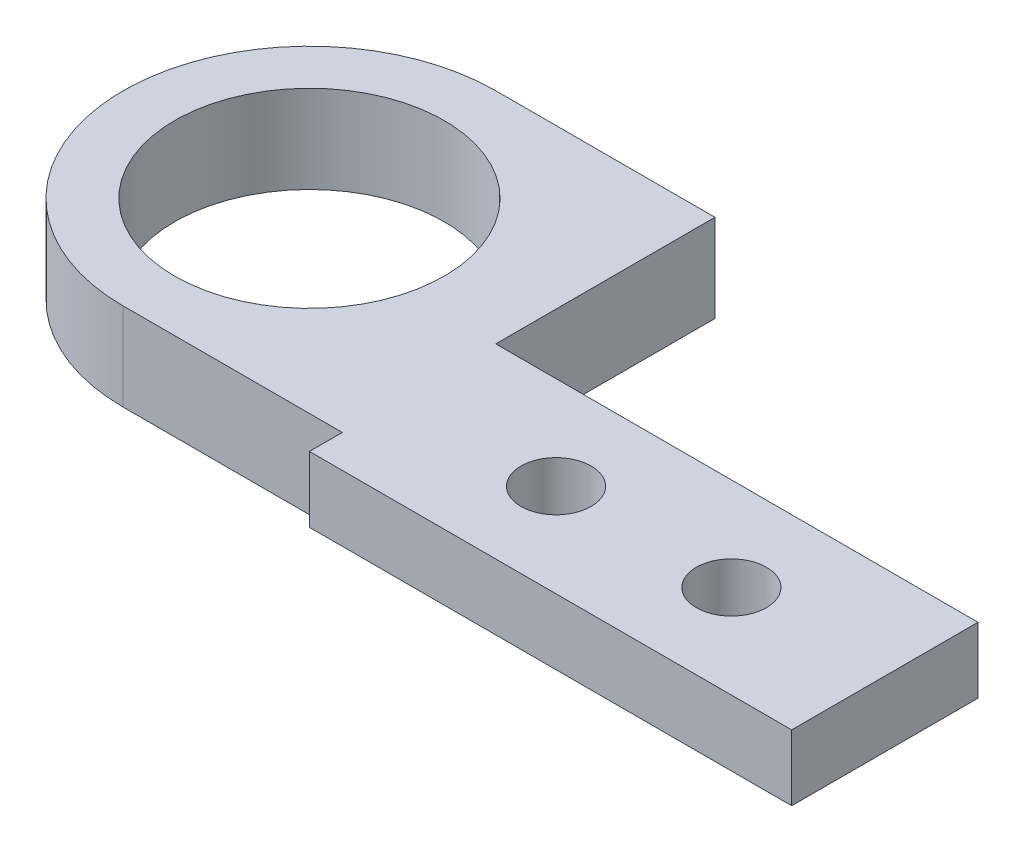
ISO-10303-21;
HEADER;
FILE_DESCRIPTION(('STEP AP214'),'2;1');
FILE_NAME('part.step','',(''),(''),'','','');
FILE_SCHEMA(('AUTOMOTIVE_DESIGN { 1 0 10303 214 1 1 1 1 }'));
ENDSEC;
DATA;
#1=APPLICATION_CONTEXT('core data for automotive mechanical design processes');
#2=APPLICATION_PROTOCOL_DEFINITION('international standard','automotive_design',2000,#1);
#3=PRODUCT_CONTEXT('',#1,'mechanical');
#4=PRODUCT('Part','Part','',(#3));
#5=PRODUCT_RELATED_PRODUCT_CATEGORY('part','',(#4));
#6=PRODUCT_DEFINITION_FORMATION('','',#4);
#7=PRODUCT_DEFINITION_CONTEXT('part definition',#1,'design');
#8=PRODUCT_DEFINITION('design','',#6,#7);
#9=PRODUCT_DEFINITION_SHAPE('','',#8);
#10=(LENGTH_UNIT() NAMED_UNIT(*) SI_UNIT(.MILLI.,.METRE.));
#11=(NAMED_UNIT(*) PLANE_ANGLE_UNIT() SI_UNIT($,.RADIAN.));
#12=(NAMED_UNIT(*) SI_UNIT($,.STERADIAN.) SOLID_ANGLE_UNIT());
#13=UNCERTAINTY_MEASURE_WITH_UNIT(LENGTH_MEASURE(1.E-05),#10,'distance_accuracy_value','');
#14=(GEOMETRIC_REPRESENTATION_CONTEXT(3) GLOBAL_UNCERTAINTY_ASSIGNED_CONTEXT((#13)) GLOBAL_UNIT_ASSIGNED_CONTEXT((#10,
#11,#12)) REPRESENTATION_CONTEXT('',''));
#15=CARTESIAN_POINT('',(0.,0.,0.));
#16=DIRECTION('',(0.,0.,1.));
#17=DIRECTION('',(1.,0.,0.));
#18=AXIS2_PLACEMENT_3D('',#15,#16,#17);
#19=CARTESIAN_POINT('',(2.21091127309406,4.,0.));
#20=DIRECTION('',(-1.,0.,0.));
#21=DIRECTION('',(0.,0.,1.));
#22=AXIS2_PLACEMENT_3D('',#19,#20,#21);
#23=PLANE('',#22);
#24=DIRECTION('',(0.,1.,0.));
#25=VECTOR('',#24,1.);
#26=CARTESIAN_POINT('',(2.21091127309406,1.,1.5));
#27=LINE('',#26,#25);
#28=CARTESIAN_POINT('',(2.21091127309406,1.,1.5));
#29=VERTEX_POINT('',#28);
#30=CARTESIAN_POINT('',(2.21091127309406,4.,1.5));
#31=VERTEX_POINT('',#30);
#32=EDGE_CURVE('E129',#29,#31,#27,.T.);
#33=ORIENTED_EDGE('',*,*,#32,.F.);
#34=DIRECTION('',(0.,0.,1.));
#35=VECTOR('',#34,1.);
#36=CARTESIAN_POINT('',(2.21091127309406,1.,1.5));
#37=LINE('',#36,#35);
#38=CARTESIAN_POINT('',(2.21091127309406,1.,8.5));
#39=VERTEX_POINT('',#38);
#40=EDGE_CURVE('E134',#29,#39,#37,.T.);
#41=ORIENTED_EDGE('',*,*,#40,.T.);
#42=DIRECTION('',(0.,-1.,0.));
#43=VECTOR('',#42,1.);
#44=CARTESIAN_POINT('',(2.21091127309406,4.,8.5));
#45=LINE('',#44,#43);
#46=CARTESIAN_POINT('',(2.21091127309406,0.,8.5));
#47=VERTEX_POINT('',#46);
#48=EDGE_CURVE('E179',#39,#47,#45,.T.);
#49=ORIENTED_EDGE('',*,*,#48,.T.);
#50=DIRECTION('',(0.,0.,-1.));
#51=VECTOR('',#50,1.);
#52=CARTESIAN_POINT('',(2.21091127309406,0.,0.));
#53=LINE('',#52,#51);
#54=CARTESIAN_POINT('',(2.21091127309407,0.,-8.5));
#55=VERTEX_POINT('',#54);
#56=EDGE_CURVE('E157',#47,#55,#53,.T.);
#57=ORIENTED_EDGE('',*,*,#56,.T.);
#58=DIRECTION('',(0.,-1.,0.));
#59=VECTOR('',#58,1.);
#60=CARTESIAN_POINT('',(2.21091127309407,4.,-8.5));
#61=LINE('',#60,#59);
#62=CARTESIAN_POINT('',(2.21091127309407,4.,-8.5));
#63=VERTEX_POINT('',#62);
#64=EDGE_CURVE('E81',#63,#55,#61,.T.);
#65=ORIENTED_EDGE('',*,*,#64,.F.);
#66=DIRECTION('',(0.,0.,-1.));
#67=VECTOR('',#66,1.);
#68=CARTESIAN_POINT('',(2.21091127309406,4.,0.));
#69=LINE('',#68,#67);
#70=EDGE_CURVE('E61',#31,#63,#69,.T.);
#71=ORIENTED_EDGE('',*,*,#70,.F.);
#72=EDGE_LOOP('',(#33,#41,#49,#57,#65,#71));
#73=FACE_BOUND('',#72,.T.);
#74=ADVANCED_FACE('F35',(#73),#23,.F.);
#75=CARTESIAN_POINT('',(0.,4.,-8.5));
#76=DIRECTION('',(0.,0.,-1.));
#77=DIRECTION('',(-1.,0.,0.));
#78=AXIS2_PLACEMENT_3D('',#75,#76,#77);
#79=PLANE('',#78);
#80=DIRECTION('',(1.,0.,0.));
#81=VECTOR('',#80,1.);
#82=CARTESIAN_POINT('',(0.,0.,-8.5));
#83=LINE('',#82,#81);
#84=CARTESIAN_POINT('',(-7.78908872690593,0.,-8.5));
#85=VERTEX_POINT('',#84);
#86=EDGE_CURVE('E168',#85,#55,#83,.T.);
#87=ORIENTED_EDGE('',*,*,#86,.F.);
#88=DIRECTION('',(0.,-1.,0.));
#89=VECTOR('',#88,1.);
#90=CARTESIAN_POINT('',(-7.78908872690593,4.,-8.5));
#91=LINE('',#90,#89);
#92=CARTESIAN_POINT('',(-7.78908872690593,4.,-8.5));
#93=VERTEX_POINT('',#92);
#94=EDGE_CURVE('E11',#93,#85,#91,.T.);
#95=ORIENTED_EDGE('',*,*,#94,.F.);
#96=DIRECTION('',(1.,0.,0.));
#97=VECTOR('',#96,1.);
#98=CARTESIAN_POINT('',(0.,4.,-8.5));
#99=LINE('',#98,#97);
#100=EDGE_CURVE('E156',#93,#63,#99,.T.);
#101=ORIENTED_EDGE('',*,*,#100,.T.);
#102=ORIENTED_EDGE('',*,*,#64,.T.);
#103=EDGE_LOOP('',(#87,#95,#101,#102));
#104=FACE_BOUND('',#103,.T.);
#105=ADVANCED_FACE('F208',(#104),#79,.T.);
#106=CARTESIAN_POINT('',(-7.78908872690593,4.,0.));
#107=DIRECTION('',(0.,-1.,0.));
#108=DIRECTION('',(0.,0.,-1.));
#109=AXIS2_PLACEMENT_3D('',#106,#107,#108);
#110=CYLINDRICAL_SURFACE('',#109,8.5);
#111=CARTESIAN_POINT('',(-7.78908872690593,0.,0.));
#112=DIRECTION('',(0.,1.,0.));
#113=DIRECTION('',(0.,0.,1.));
#114=AXIS2_PLACEMENT_3D('',#111,#112,#113);
#115=CIRCLE('',#114,8.5);
#116=CARTESIAN_POINT('',(-7.78908872690593,0.,8.5));
#117=VERTEX_POINT('',#116);
#118=EDGE_CURVE('E171',#85,#117,#115,.T.);
#119=ORIENTED_EDGE('',*,*,#118,.T.);
#120=DIRECTION('',(0.,-1.,0.));
#121=VECTOR('',#120,1.);
#122=CARTESIAN_POINT('',(-7.78908872690593,4.,8.5));
#123=LINE('',#122,#121);
#124=CARTESIAN_POINT('',(-7.78908872690593,4.,8.5));
#125=VERTEX_POINT('',#124);
#126=EDGE_CURVE('E44',#125,#117,#123,.T.);
#127=ORIENTED_EDGE('',*,*,#126,.F.);
#128=CARTESIAN_POINT('',(-7.78908872690593,4.,0.));
#129=DIRECTION('',(0.,1.,0.));
#130=DIRECTION('',(0.,0.,1.));
#131=AXIS2_PLACEMENT_3D('',#128,#129,#130);
#132=CIRCLE('',#131,8.5);
#133=EDGE_CURVE('E159',#93,#125,#132,.T.);
#134=ORIENTED_EDGE('',*,*,#133,.F.);
#135=ORIENTED_EDGE('',*,*,#94,.T.);
#136=EDGE_LOOP('',(#119,#127,#134,#135));
#137=FACE_BOUND('',#136,.T.);
#138=ADVANCED_FACE('F210',(#137),#110,.T.);
#139=CARTESIAN_POINT('',(0.,4.,8.5));
#140=DIRECTION('',(0.,0.,-1.));
#141=DIRECTION('',(-1.,0.,0.));
#142=AXIS2_PLACEMENT_3D('',#139,#140,#141);
#143=PLANE('',#142);
#144=DIRECTION('',(1.,0.,0.));
#145=VECTOR('',#144,1.);
#146=CARTESIAN_POINT('',(0.,0.,8.5));
#147=LINE('',#146,#145);
#148=EDGE_CURVE('E174',#117,#47,#147,.T.);
#149=ORIENTED_EDGE('',*,*,#148,.T.);
#150=ORIENTED_EDGE('',*,*,#48,.F.);
#151=CARTESIAN_POINT('',(2.21091127309406,4.,8.5));
#152=VERTEX_POINT('',#151);
#153=EDGE_CURVE('E180',#152,#39,#45,.T.);
#154=ORIENTED_EDGE('',*,*,#153,.F.);
#155=DIRECTION('',(1.,0.,0.));
#156=VECTOR('',#155,1.);
#157=CARTESIAN_POINT('',(0.,4.,8.5));
#158=LINE('',#157,#156);
#159=EDGE_CURVE('E162',#125,#152,#158,.T.);
#160=ORIENTED_EDGE('',*,*,#159,.F.);
#161=ORIENTED_EDGE('',*,*,#126,.T.);
#162=EDGE_LOOP('',(#149,#150,#154,#160,#161));
#163=FACE_BOUND('',#162,.T.);
#164=ADVANCED_FACE('F215',(#163),#143,.F.);
#165=CARTESIAN_POINT('',(-7.78908872690593,4.,0.));
#166=DIRECTION('',(0.,-1.,0.));
#167=DIRECTION('',(0.,0.,-1.));
#168=AXIS2_PLACEMENT_3D('',#165,#166,#167);
#169=CYLINDRICAL_SURFACE('',#168,6.15);
#170=CARTESIAN_POINT('',(-7.78908872690593,4.,0.));
#171=DIRECTION('',(0.,1.,0.));
#172=DIRECTION('',(0.,0.,1.));
#173=AXIS2_PLACEMENT_3D('',#170,#171,#172);
#174=CIRCLE('',#173,6.15);
#175=CARTESIAN_POINT('',(-7.78908872690593,4.,6.15));
#176=VERTEX_POINT('',#175);
#177=EDGE_CURVE('E153',#176,#176,#174,.T.);
#178=ORIENTED_EDGE('',*,*,#177,.T.);
#179=EDGE_LOOP('',(#178));
#180=FACE_BOUND('',#179,.T.);
#181=CARTESIAN_POINT('',(-7.78908872690593,0.,0.));
#182=DIRECTION('',(0.,1.,0.));
#183=DIRECTION('',(0.,0.,1.));
#184=AXIS2_PLACEMENT_3D('',#181,#182,#183);
#185=CIRCLE('',#184,6.15);
#186=CARTESIAN_POINT('',(-7.78908872690593,0.,6.15));
#187=VERTEX_POINT('',#186);
#188=EDGE_CURVE('E148',#187,#187,#185,.T.);
#189=ORIENTED_EDGE('',*,*,#188,.F.);
#190=EDGE_LOOP('',(#189));
#191=FACE_BOUND('',#190,.T.);
#192=ADVANCED_FACE('F37',(#180,#191),#169,.F.);
#193=CARTESIAN_POINT('',(0.,4.,0.));
#194=DIRECTION('',(0.,1.,0.));
#195=DIRECTION('',(0.,0.,1.));
#196=AXIS2_PLACEMENT_3D('',#193,#194,#195);
#197=PLANE('',#196);
#198=CARTESIAN_POINT('',(9.21091127309407,4.,5.75));
#199=DIRECTION('',(0.,1.,0.));
#200=DIRECTION('',(0.,0.,1.));
#201=AXIS2_PLACEMENT_3D('',#198,#199,#200);
#202=CIRCLE('',#201,1.6);
#203=CARTESIAN_POINT('',(9.21091127309407,4.,7.35));
#204=VERTEX_POINT('',#203);
#205=EDGE_CURVE('E185',#204,#204,#202,.T.);
#206=ORIENTED_EDGE('',*,*,#205,.F.);
#207=EDGE_LOOP('',(#206));
#208=FACE_BOUND('',#207,.T.);
#209=CARTESIAN_POINT('',(17.2109112730941,4.,5.75));
#210=DIRECTION('',(0.,1.,0.));
#211=DIRECTION('',(0.,0.,1.));
#212=AXIS2_PLACEMENT_3D('',#209,#210,#211);
#213=CIRCLE('',#212,1.6);
#214=CARTESIAN_POINT('',(17.2109112730941,4.,7.35));
#215=VERTEX_POINT('',#214);
#216=EDGE_CURVE('E190',#215,#215,#213,.T.);
#217=ORIENTED_EDGE('',*,*,#216,.F.);
#218=EDGE_LOOP('',(#217));
#219=FACE_BOUND('',#218,.T.);
#220=ORIENTED_EDGE('',*,*,#177,.F.);
#221=EDGE_LOOP('',(#220));
#222=FACE_BOUND('',#221,.T.);
#223=ORIENTED_EDGE('',*,*,#100,.F.);
#224=ORIENTED_EDGE('',*,*,#133,.T.);
#225=ORIENTED_EDGE('',*,*,#159,.T.);
#226=DIRECTION('',(0.,0.,1.));
#227=VECTOR('',#226,1.);
#228=CARTESIAN_POINT('',(2.21091127309406,4.,8.50000000000001));
#229=LINE('',#228,#227);
#230=CARTESIAN_POINT('',(2.21091127309406,4.,10.));
#231=VERTEX_POINT('',#230);
#232=EDGE_CURVE('E143',#152,#231,#229,.T.);
#233=ORIENTED_EDGE('',*,*,#232,.T.);
#234=DIRECTION('',(1.,0.,0.));
#235=VECTOR('',#234,1.);
#236=CARTESIAN_POINT('',(2.21091127309406,4.,10.));
#237=LINE('',#236,#235);
#238=CARTESIAN_POINT('',(24.2109112730941,4.,10.));
#239=VERTEX_POINT('',#238);
#240=EDGE_CURVE('E121',#231,#239,#237,.T.);
#241=ORIENTED_EDGE('',*,*,#240,.T.);
#242=DIRECTION('',(0.,0.,-1.));
#243=VECTOR('',#242,1.);
#244=CARTESIAN_POINT('',(24.2109112730941,4.,1.5));
#245=LINE('',#244,#243);
#246=CARTESIAN_POINT('',(24.2109112730941,4.,1.5));
#247=VERTEX_POINT('',#246);
#248=EDGE_CURVE('E140',#239,#247,#245,.T.);
#249=ORIENTED_EDGE('',*,*,#248,.T.);
#250=DIRECTION('',(-1.,0.,0.));
#251=VECTOR('',#250,1.);
#252=CARTESIAN_POINT('',(24.2109112730941,4.,1.5));
#253=LINE('',#252,#251);
#254=EDGE_CURVE('E127',#247,#31,#253,.T.);
#255=ORIENTED_EDGE('',*,*,#254,.T.);
#256=ORIENTED_EDGE('',*,*,#70,.T.);
#257=EDGE_LOOP('',(#223,#224,#225,#233,#241,#249,#255,#256));
#258=FACE_BOUND('',#257,.T.);
#259=ADVANCED_FACE('F200',(#208,#219,#222,#258),#197,.T.);
#260=CARTESIAN_POINT('',(0.,0.,0.));
#261=DIRECTION('',(0.,1.,0.));
#262=DIRECTION('',(0.,0.,1.));
#263=AXIS2_PLACEMENT_3D('',#260,#261,#262);
#264=PLANE('',#263);
#265=ORIENTED_EDGE('',*,*,#188,.T.);
#266=EDGE_LOOP('',(#265));
#267=FACE_BOUND('',#266,.T.);
#268=ORIENTED_EDGE('',*,*,#86,.T.);
#269=ORIENTED_EDGE('',*,*,#56,.F.);
#270=ORIENTED_EDGE('',*,*,#148,.F.);
#271=ORIENTED_EDGE('',*,*,#118,.F.);
#272=EDGE_LOOP('',(#268,#269,#270,#271));
#273=FACE_BOUND('',#272,.T.);
#274=ADVANCED_FACE('F203',(#267,#273),#264,.F.);
#275=CARTESIAN_POINT('',(2.21091127309406,1.,10.));
#276=DIRECTION('',(0.,0.,1.));
#277=DIRECTION('',(1.,0.,0.));
#278=AXIS2_PLACEMENT_3D('',#275,#276,#277);
#279=PLANE('',#278);
#280=ORIENTED_EDGE('',*,*,#240,.F.);
#281=DIRECTION('',(0.,1.,0.));
#282=VECTOR('',#281,1.);
#283=CARTESIAN_POINT('',(2.21091127309406,1.,10.));
#284=LINE('',#283,#282);
#285=CARTESIAN_POINT('',(2.21091127309406,1.,10.));
#286=VERTEX_POINT('',#285);
#287=EDGE_CURVE('E149',#286,#231,#284,.T.);
#288=ORIENTED_EDGE('',*,*,#287,.F.);
#289=DIRECTION('',(1.,0.,0.));
#290=VECTOR('',#289,1.);
#291=CARTESIAN_POINT('',(2.21091127309406,1.,10.));
#292=LINE('',#291,#290);
#293=CARTESIAN_POINT('',(24.2109112730941,1.,10.));
#294=VERTEX_POINT('',#293);
#295=EDGE_CURVE('E130',#286,#294,#292,.T.);
#296=ORIENTED_EDGE('',*,*,#295,.T.);
#297=DIRECTION('',(0.,1.,0.));
#298=VECTOR('',#297,1.);
#299=CARTESIAN_POINT('',(24.2109112730941,1.,10.));
#300=LINE('',#299,#298);
#301=EDGE_CURVE('E117',#294,#239,#300,.T.);
#302=ORIENTED_EDGE('',*,*,#301,.T.);
#303=EDGE_LOOP('',(#280,#288,#296,#302));
#304=FACE_BOUND('',#303,.T.);
#305=ADVANCED_FACE('F225',(#304),#279,.T.);
#306=CARTESIAN_POINT('',(2.21091127309406,1.,8.50000000000001));
#307=DIRECTION('',(-1.,0.,0.));
#308=DIRECTION('',(0.,0.,1.));
#309=AXIS2_PLACEMENT_3D('',#306,#307,#308);
#310=PLANE('',#309);
#311=ORIENTED_EDGE('',*,*,#232,.F.);
#312=ORIENTED_EDGE('',*,*,#153,.T.);
#313=EDGE_CURVE('E52',#39,#286,#37,.T.);
#314=ORIENTED_EDGE('',*,*,#313,.T.);
#315=ORIENTED_EDGE('',*,*,#287,.T.);
#316=EDGE_LOOP('',(#311,#312,#314,#315));
#317=FACE_BOUND('',#316,.T.);
#318=ADVANCED_FACE('F232',(#317),#310,.T.);
#319=CARTESIAN_POINT('',(24.2109112730941,1.,1.5));
#320=DIRECTION('',(0.,0.,-1.));
#321=DIRECTION('',(-1.,0.,0.));
#322=AXIS2_PLACEMENT_3D('',#319,#320,#321);
#323=PLANE('',#322);
#324=ORIENTED_EDGE('',*,*,#254,.F.);
#325=DIRECTION('',(0.,1.,0.));
#326=VECTOR('',#325,1.);
#327=CARTESIAN_POINT('',(24.2109112730941,1.,1.5));
#328=LINE('',#327,#326);
#329=CARTESIAN_POINT('',(24.2109112730941,1.,1.5));
#330=VERTEX_POINT('',#329);
#331=EDGE_CURVE('E114',#330,#247,#328,.T.);
#332=ORIENTED_EDGE('',*,*,#331,.F.);
#333=DIRECTION('',(-1.,0.,0.));
#334=VECTOR('',#333,1.);
#335=CARTESIAN_POINT('',(24.2109112730941,1.,1.5));
#336=LINE('',#335,#334);
#337=EDGE_CURVE('E120',#330,#29,#336,.T.);
#338=ORIENTED_EDGE('',*,*,#337,.T.);
#339=ORIENTED_EDGE('',*,*,#32,.T.);
#340=EDGE_LOOP('',(#324,#332,#338,#339));
#341=FACE_BOUND('',#340,.T.);
#342=ADVANCED_FACE('F125',(#341),#323,.T.);
#343=CARTESIAN_POINT('',(24.2109112730941,1.,1.5));
#344=DIRECTION('',(1.,0.,0.));
#345=DIRECTION('',(0.,0.,-1.));
#346=AXIS2_PLACEMENT_3D('',#343,#344,#345);
#347=PLANE('',#346);
#348=ORIENTED_EDGE('',*,*,#248,.F.);
#349=ORIENTED_EDGE('',*,*,#301,.F.);
#350=DIRECTION('',(0.,0.,-1.));
#351=VECTOR('',#350,1.);
#352=CARTESIAN_POINT('',(24.2109112730941,1.,8.5));
#353=LINE('',#352,#351);
#354=EDGE_CURVE('E111',#294,#330,#353,.T.);
#355=ORIENTED_EDGE('',*,*,#354,.T.);
#356=ORIENTED_EDGE('',*,*,#331,.T.);
#357=EDGE_LOOP('',(#348,#349,#355,#356));
#358=FACE_BOUND('',#357,.T.);
#359=ADVANCED_FACE('F113',(#358),#347,.T.);
#360=CARTESIAN_POINT('',(0.,1.,0.));
#361=DIRECTION('',(0.,1.,0.));
#362=DIRECTION('',(0.,0.,1.));
#363=AXIS2_PLACEMENT_3D('',#360,#361,#362);
#364=PLANE('',#363);
#365=CARTESIAN_POINT('',(9.21091127309407,1.,5.75));
#366=DIRECTION('',(0.,1.,0.));
#367=DIRECTION('',(0.,0.,1.));
#368=AXIS2_PLACEMENT_3D('',#365,#366,#367);
#369=CIRCLE('',#368,1.6);
#370=CARTESIAN_POINT('',(9.21091127309407,1.,7.35));
#371=VERTEX_POINT('',#370);
#372=EDGE_CURVE('E39',#371,#371,#369,.T.);
#373=ORIENTED_EDGE('',*,*,#372,.T.);
#374=EDGE_LOOP('',(#373));
#375=FACE_BOUND('',#374,.T.);
#376=CARTESIAN_POINT('',(17.2109112730941,1.,5.75));
#377=DIRECTION('',(0.,1.,0.));
#378=DIRECTION('',(0.,0.,1.));
#379=AXIS2_PLACEMENT_3D('',#376,#377,#378);
#380=CIRCLE('',#379,1.6);
#381=CARTESIAN_POINT('',(17.2109112730941,1.,7.35));
#382=VERTEX_POINT('',#381);
#383=EDGE_CURVE('E183',#382,#382,#380,.T.);
#384=ORIENTED_EDGE('',*,*,#383,.T.);
#385=EDGE_LOOP('',(#384));
#386=FACE_BOUND('',#385,.T.);
#387=ORIENTED_EDGE('',*,*,#354,.F.);
#388=ORIENTED_EDGE('',*,*,#295,.F.);
#389=ORIENTED_EDGE('',*,*,#313,.F.);
#390=ORIENTED_EDGE('',*,*,#40,.F.);
#391=ORIENTED_EDGE('',*,*,#337,.F.);
#392=EDGE_LOOP('',(#387,#388,#389,#390,#391));
#393=FACE_BOUND('',#392,.T.);
#394=ADVANCED_FACE('F132',(#375,#386,#393),#364,.F.);
#395=CARTESIAN_POINT('',(17.2109112730941,-6.,5.75));
#396=DIRECTION('',(0.,1.,0.));
#397=DIRECTION('',(0.,0.,1.));
#398=AXIS2_PLACEMENT_3D('',#395,#396,#397);
#399=CYLINDRICAL_SURFACE('',#398,1.6);
#400=ORIENTED_EDGE('',*,*,#216,.T.);
#401=EDGE_LOOP('',(#400));
#402=FACE_BOUND('',#401,.T.);
#403=ORIENTED_EDGE('',*,*,#383,.F.);
#404=EDGE_LOOP('',(#403));
#405=FACE_BOUND('',#404,.T.);
#406=ADVANCED_FACE('F197',(#402,#405),#399,.F.);
#407=CARTESIAN_POINT('',(9.21091127309407,-6.,5.75));
#408=DIRECTION('',(0.,1.,0.));
#409=DIRECTION('',(0.,0.,1.));
#410=AXIS2_PLACEMENT_3D('',#407,#408,#409);
#411=CYLINDRICAL_SURFACE('',#410,1.6);
#412=ORIENTED_EDGE('',*,*,#205,.T.);
#413=EDGE_LOOP('',(#412));
#414=FACE_BOUND('',#413,.T.);
#415=ORIENTED_EDGE('',*,*,#372,.F.);
#416=EDGE_LOOP('',(#415));
#417=FACE_BOUND('',#416,.T.);
#418=ADVANCED_FACE('F244',(#414,#417),#411,.F.);
#419=CLOSED_SHELL('',(#74,#105,#138,#164,#192,#259,#274,#305,#318,#342,#359,#394,#406,#418));
#420=MANIFOLD_SOLID_BREP('B2',#419);
#421=ADVANCED_BREP_SHAPE_REPRESENTATION('',(#18,#420),#14);
#422=SHAPE_DEFINITION_REPRESENTATION(#9,#421);
ENDSEC;
END-ISO-10303-21;
